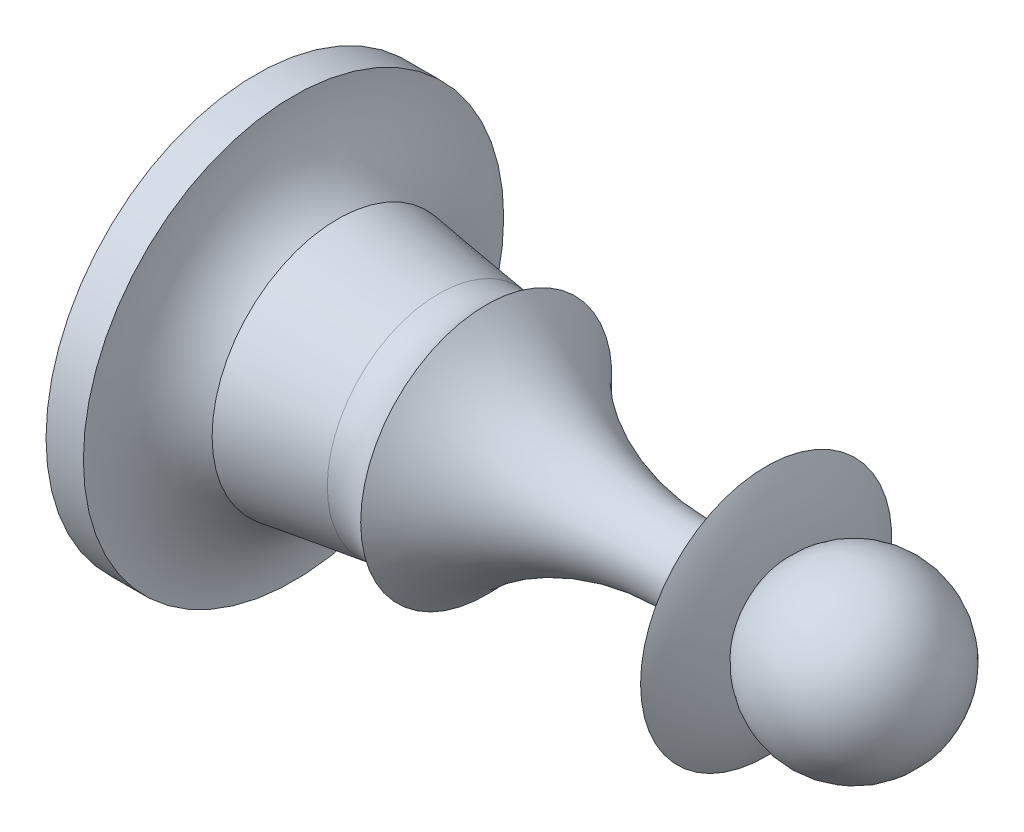
ISO-10303-21;
HEADER;
FILE_DESCRIPTION(('STEP AP214'),'2;1');
FILE_NAME('part.step','',(''),(''),'','','');
FILE_SCHEMA(('AUTOMOTIVE_DESIGN { 1 0 10303 214 1 1 1 1 }'));
ENDSEC;
DATA;
#1=APPLICATION_CONTEXT('core data for automotive mechanical design processes');
#2=APPLICATION_PROTOCOL_DEFINITION('international standard','automotive_design',2000,#1);
#3=PRODUCT_CONTEXT('',#1,'mechanical');
#4=PRODUCT('Part','Part','',(#3));
#5=PRODUCT_RELATED_PRODUCT_CATEGORY('part','',(#4));
#6=PRODUCT_DEFINITION_FORMATION('','',#4);
#7=PRODUCT_DEFINITION_CONTEXT('part definition',#1,'design');
#8=PRODUCT_DEFINITION('design','',#6,#7);
#9=PRODUCT_DEFINITION_SHAPE('','',#8);
#10=(LENGTH_UNIT() NAMED_UNIT(*) SI_UNIT(.MILLI.,.METRE.));
#11=(NAMED_UNIT(*) PLANE_ANGLE_UNIT() SI_UNIT($,.RADIAN.));
#12=(NAMED_UNIT(*) SI_UNIT($,.STERADIAN.) SOLID_ANGLE_UNIT());
#13=UNCERTAINTY_MEASURE_WITH_UNIT(LENGTH_MEASURE(1.E-05),#10,'distance_accuracy_value','');
#14=(GEOMETRIC_REPRESENTATION_CONTEXT(3) GLOBAL_UNCERTAINTY_ASSIGNED_CONTEXT((#13)) GLOBAL_UNIT_ASSIGNED_CONTEXT((#10,
#11,#12)) REPRESENTATION_CONTEXT('',''));
#15=CARTESIAN_POINT('',(0.,0.,0.));
#16=DIRECTION('',(0.,0.,1.));
#17=DIRECTION('',(1.,0.,0.));
#18=AXIS2_PLACEMENT_3D('',#15,#16,#17);
#19=CARTESIAN_POINT('',(0.,0.,0.));
#20=DIRECTION('',(1.,0.,0.));
#21=DIRECTION('',(0.,0.,-1.));
#22=AXIS2_PLACEMENT_3D('',#19,#20,#21);
#23=PLANE('',#22);
#24=CARTESIAN_POINT('',(0.,0.,0.));
#25=DIRECTION('',(-1.,0.,0.));
#26=DIRECTION('',(0.,0.,1.));
#27=AXIS2_PLACEMENT_3D('',#24,#25,#26);
#28=CIRCLE('',#27,50.3355704697987);
#29=CARTESIAN_POINT('',(0.,0.,50.3355704697987));
#30=VERTEX_POINT('',#29);
#31=EDGE_CURVE('E10',#30,#30,#28,.T.);
#32=ORIENTED_EDGE('',*,*,#31,.T.);
#33=EDGE_LOOP('',(#32));
#34=FACE_BOUND('',#33,.T.);
#35=ADVANCED_FACE('F35',(#34),#23,.F.);
#36=CARTESIAN_POINT('',(0.,0.,0.));
#37=DIRECTION('',(-1.,0.,0.));
#38=DIRECTION('',(0.,0.,1.));
#39=AXIS2_PLACEMENT_3D('',#36,#37,#38);
#40=CYLINDRICAL_SURFACE('',#39,50.3355704697987);
#41=ORIENTED_EDGE('',*,*,#31,.F.);
#42=EDGE_LOOP('',(#41));
#43=FACE_BOUND('',#42,.T.);
#44=CARTESIAN_POINT('',(8.94854586129756,0.,0.));
#45=DIRECTION('',(-1.,0.,0.));
#46=DIRECTION('',(0.,0.,1.));
#47=AXIS2_PLACEMENT_3D('',#44,#45,#46);
#48=CIRCLE('',#47,50.3355704697987);
#49=CARTESIAN_POINT('',(8.94854586129756,0.,50.3355704697987));
#50=VERTEX_POINT('',#49);
#51=EDGE_CURVE('E41',#50,#50,#48,.T.);
#52=ORIENTED_EDGE('',*,*,#51,.T.);
#53=EDGE_LOOP('',(#52));
#54=FACE_BOUND('',#53,.T.);
#55=ADVANCED_FACE('F79',(#43,#54),#40,.T.);
#56=CARTESIAN_POINT('',(33.6159062020968,0.,0.));
#57=DIRECTION('',(-1.,0.,0.));
#58=DIRECTION('',(0.,0.,1.));
#59=AXIS2_PLACEMENT_3D('',#56,#57,#58);
#60=TOROIDAL_SURFACE('',#59,50.3355704697987,24.6673603407993);
#61=ORIENTED_EDGE('',*,*,#51,.F.);
#62=EDGE_LOOP('',(#61));
#63=FACE_BOUND('',#62,.T.);
#64=CARTESIAN_POINT('',(19.5273603488052,0.,0.));
#65=DIRECTION('',(-1.,0.,0.));
#66=DIRECTION('',(0.,0.,1.));
#67=AXIS2_PLACEMENT_3D('',#64,#65,#66);
#68=CIRCLE('',#67,30.0873225968953);
#69=CARTESIAN_POINT('',(19.5273603488052,0.,30.0873225968953));
#70=VERTEX_POINT('',#69);
#71=EDGE_CURVE('E45',#70,#70,#68,.T.);
#72=ORIENTED_EDGE('',*,*,#71,.T.);
#73=EDGE_LOOP('',(#72));
#74=FACE_BOUND('',#73,.T.);
#75=ADVANCED_FACE('F83',(#63,#74),#60,.F.);
#76=CARTESIAN_POINT('',(43.7116136750427,0.,0.));
#77=DIRECTION('',(-1.,0.,0.));
#78=DIRECTION('',(0.,0.,1.));
#79=AXIS2_PLACEMENT_3D('',#76,#77,#78);
#80=CONICAL_SURFACE('',#79,26.6804049014729,0.139952436944965);
#81=ORIENTED_EDGE('',*,*,#71,.F.);
#82=EDGE_LOOP('',(#81));
#83=FACE_BOUND('',#82,.T.);
#84=CARTESIAN_POINT('',(43.7116136750427,0.,0.));
#85=DIRECTION('',(-1.,0.,0.));
#86=DIRECTION('',(0.,0.,1.));
#87=AXIS2_PLACEMENT_3D('',#84,#85,#86);
#88=CIRCLE('',#87,26.6804049014729);
#89=CARTESIAN_POINT('',(43.7116136750427,0.,26.6804049014729));
#90=VERTEX_POINT('',#89);
#91=EDGE_CURVE('E49',#90,#90,#88,.T.);
#92=ORIENTED_EDGE('',*,*,#91,.T.);
#93=EDGE_LOOP('',(#92));
#94=FACE_BOUND('',#93,.T.);
#95=ADVANCED_FACE('F88',(#83,#94),#80,.T.);
#96=CARTESIAN_POINT('',(45.7028212283306,0.,0.));
#97=DIRECTION('',(-1.,0.,0.));
#98=DIRECTION('',(0.,0.,1.));
#99=AXIS2_PLACEMENT_3D('',#96,#97,#98);
#100=TOROIDAL_SURFACE('',#99,40.8151367027529,14.2742968518378);
#101=ORIENTED_EDGE('',*,*,#91,.F.);
#102=EDGE_LOOP('',(#101));
#103=FACE_BOUND('',#102,.T.);
#104=CARTESIAN_POINT('',(55.1192725304162,0.,0.));
#105=DIRECTION('',(-1.,0.,0.));
#106=DIRECTION('',(0.,0.,1.));
#107=AXIS2_PLACEMENT_3D('',#104,#105,#106);
#108=CIRCLE('',#107,30.0873225968953);
#109=CARTESIAN_POINT('',(55.1192725304162,0.,30.0873225968953));
#110=VERTEX_POINT('',#109);
#111=EDGE_CURVE('E54',#110,#110,#108,.T.);
#112=ORIENTED_EDGE('',*,*,#111,.T.);
#113=EDGE_LOOP('',(#112));
#114=FACE_BOUND('',#113,.T.);
#115=ADVANCED_FACE('F94',(#103,#114),#100,.F.);
#116=CARTESIAN_POINT('',(102.080119416365,0.,0.));
#117=DIRECTION('',(-1.,0.,0.));
#118=DIRECTION('',(0.,0.,1.));
#119=AXIS2_PLACEMENT_3D('',#116,#117,#118);
#120=TOROIDAL_SURFACE('',#119,70.6397820175624,62.0469427555492);
#121=ORIENTED_EDGE('',*,*,#111,.F.);
#122=EDGE_LOOP('',(#121));
#123=FACE_BOUND('',#122,.T.);
#124=CARTESIAN_POINT('',(117.225950782998,0.,0.));
#125=DIRECTION('',(-1.,0.,0.));
#126=DIRECTION('',(0.,0.,1.));
#127=AXIS2_PLACEMENT_3D('',#124,#125,#126);
#128=CIRCLE('',#127,10.4697986577182);
#129=CARTESIAN_POINT('',(117.225950782998,0.,10.4697986577182));
#130=VERTEX_POINT('',#129);
#131=EDGE_CURVE('E57',#130,#130,#128,.T.);
#132=ORIENTED_EDGE('',*,*,#131,.T.);
#133=EDGE_LOOP('',(#132));
#134=FACE_BOUND('',#133,.T.);
#135=ADVANCED_FACE('F98',(#123,#134),#120,.F.);
#136=CARTESIAN_POINT('',(158.783782426757,0.,0.));
#137=DIRECTION('',(-1.,0.,0.));
#138=DIRECTION('',(0.,0.,1.));
#139=AXIS2_PLACEMENT_3D('',#136,#137,#138);
#140=DEGENERATE_TOROIDAL_SURFACE('',#139,10.4697986577182,41.5578316437596,.T.);
#141=ORIENTED_EDGE('',*,*,#131,.F.);
#142=EDGE_LOOP('',(#141));
#143=FACE_BOUND('',#142,.T.);
#144=CARTESIAN_POINT('',(122.147651006711,0.,0.));
#145=DIRECTION('',(-1.,0.,0.));
#146=DIRECTION('',(0.,0.,1.));
#147=AXIS2_PLACEMENT_3D('',#144,#145,#146);
#148=CIRCLE('',#147,30.0873225968953);
#149=CARTESIAN_POINT('',(122.147651006711,0.,30.0873225968953));
#150=VERTEX_POINT('',#149);
#151=EDGE_CURVE('E60',#150,#150,#148,.T.);
#152=ORIENTED_EDGE('',*,*,#151,.T.);
#153=EDGE_LOOP('',(#152));
#154=FACE_BOUND('',#153,.T.);
#155=ADVANCED_FACE('F75',(#143,#154),#140,.T.);
#156=CARTESIAN_POINT('',(88.9933150275232,0.,0.));
#157=DIRECTION('',(-1.,0.,0.));
#158=DIRECTION('',(0.,0.,1.));
#159=AXIS2_PLACEMENT_3D('',#156,#157,#158);
#160=DEGENERATE_TOROIDAL_SURFACE('',#159,10.4697986577182,38.5234634959668,.T.);
#161=ORIENTED_EDGE('',*,*,#151,.F.);
#162=EDGE_LOOP('',(#161));
#163=FACE_BOUND('',#162,.T.);
#164=CARTESIAN_POINT('',(127.366777857641,0.,0.));
#165=DIRECTION('',(-1.,0.,0.));
#166=DIRECTION('',(0.,0.,1.));
#167=AXIS2_PLACEMENT_3D('',#164,#165,#166);
#168=CIRCLE('',#167,13.8660598594856);
#169=CARTESIAN_POINT('',(127.366777857641,0.,13.8660598594856));
#170=VERTEX_POINT('',#169);
#171=EDGE_CURVE('E63',#170,#170,#168,.T.);
#172=ORIENTED_EDGE('',*,*,#171,.T.);
#173=EDGE_LOOP('',(#172));
#174=FACE_BOUND('',#173,.T.);
#175=ADVANCED_FACE('F67',(#163,#174),#160,.T.);
#176=CARTESIAN_POINT('',(143.176733780761,0.,0.));
#177=DIRECTION('',(-1.,0.,0.));
#178=DIRECTION('',(0.,0.,-1.));
#179=AXIS2_PLACEMENT_3D('',#176,#177,#178);
#180=SPHERICAL_SURFACE('',#179,21.0290827740493);
#181=ORIENTED_EDGE('',*,*,#171,.F.);
#182=EDGE_LOOP('',(#181));
#183=FACE_BOUND('',#182,.T.);
#184=ADVANCED_FACE('F69',(#183),#180,.T.);
#185=CLOSED_SHELL('',(#35,#55,#75,#95,#115,#135,#155,#175,#184));
#186=MANIFOLD_SOLID_BREP('B2',#185);
#187=ADVANCED_BREP_SHAPE_REPRESENTATION('',(#18,#186),#14);
#188=SHAPE_DEFINITION_REPRESENTATION(#9,#187);
ENDSEC;
END-ISO-10303-21;
